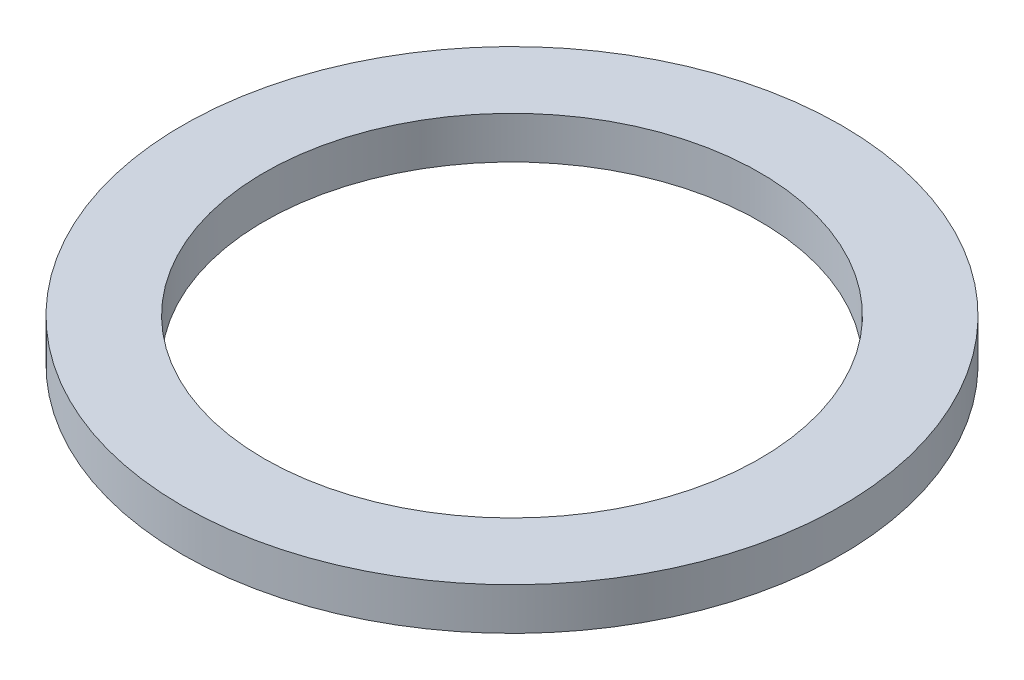
ISO-10303-21;
HEADER;
FILE_DESCRIPTION(('STEP AP214'),'2;1');
FILE_NAME('part.step','',(''),(''),'','','');
FILE_SCHEMA(('AUTOMOTIVE_DESIGN { 1 0 10303 214 1 1 1 1 }'));
ENDSEC;
DATA;
#1=APPLICATION_CONTEXT('core data for automotive mechanical design processes');
#2=APPLICATION_PROTOCOL_DEFINITION('international standard','automotive_design',2000,#1);
#3=PRODUCT_CONTEXT('',#1,'mechanical');
#4=PRODUCT('Part','Part','',(#3));
#5=PRODUCT_RELATED_PRODUCT_CATEGORY('part','',(#4));
#6=PRODUCT_DEFINITION_FORMATION('','',#4);
#7=PRODUCT_DEFINITION_CONTEXT('part definition',#1,'design');
#8=PRODUCT_DEFINITION('design','',#6,#7);
#9=PRODUCT_DEFINITION_SHAPE('','',#8);
#10=(LENGTH_UNIT() NAMED_UNIT(*) SI_UNIT(.MILLI.,.METRE.));
#11=(NAMED_UNIT(*) PLANE_ANGLE_UNIT() SI_UNIT($,.RADIAN.));
#12=(NAMED_UNIT(*) SI_UNIT($,.STERADIAN.) SOLID_ANGLE_UNIT());
#13=UNCERTAINTY_MEASURE_WITH_UNIT(LENGTH_MEASURE(1.E-05),#10,'distance_accuracy_value','');
#14=(GEOMETRIC_REPRESENTATION_CONTEXT(3) GLOBAL_UNCERTAINTY_ASSIGNED_CONTEXT((#13)) GLOBAL_UNIT_ASSIGNED_CONTEXT((#10,
#11,#12)) REPRESENTATION_CONTEXT('',''));
#15=CARTESIAN_POINT('',(0.,0.,0.));
#16=DIRECTION('',(0.,0.,1.));
#17=DIRECTION('',(1.,0.,0.));
#18=AXIS2_PLACEMENT_3D('',#15,#16,#17);
#19=CARTESIAN_POINT('',(0.,0.4064,0.));
#20=DIRECTION('',(0.,1.,0.));
#21=DIRECTION('',(0.,0.,1.));
#22=AXIS2_PLACEMENT_3D('',#19,#20,#21);
#23=PLANE('',#22);
#24=CARTESIAN_POINT('',(0.,0.4064,0.));
#25=DIRECTION('',(0.,1.,0.));
#26=DIRECTION('',(0.,0.,1.));
#27=AXIS2_PLACEMENT_3D('',#24,#25,#26);
#28=CIRCLE('',#27,3.175);
#29=CARTESIAN_POINT('',(0.,0.4064,3.175));
#30=VERTEX_POINT('',#29);
#31=EDGE_CURVE('E10',#30,#30,#28,.T.);
#32=ORIENTED_EDGE('',*,*,#31,.T.);
#33=EDGE_LOOP('',(#32));
#34=FACE_BOUND('',#33,.T.);
#35=CARTESIAN_POINT('',(0.,0.4064,0.));
#36=DIRECTION('',(0.,1.,0.));
#37=DIRECTION('',(0.,0.,1.));
#38=AXIS2_PLACEMENT_3D('',#35,#36,#37);
#39=CIRCLE('',#38,2.3876);
#40=CARTESIAN_POINT('',(0.,0.4064,2.3876));
#41=VERTEX_POINT('',#40);
#42=EDGE_CURVE('E42',#41,#41,#39,.T.);
#43=ORIENTED_EDGE('',*,*,#42,.F.);
#44=EDGE_LOOP('',(#43));
#45=FACE_BOUND('',#44,.T.);
#46=ADVANCED_FACE('F31',(#34,#45),#23,.T.);
#47=CARTESIAN_POINT('',(0.,0.,0.));
#48=DIRECTION('',(0.,1.,0.));
#49=DIRECTION('',(0.,0.,1.));
#50=AXIS2_PLACEMENT_3D('',#47,#48,#49);
#51=PLANE('',#50);
#52=CARTESIAN_POINT('',(0.,0.,0.));
#53=DIRECTION('',(0.,1.,0.));
#54=DIRECTION('',(0.,0.,1.));
#55=AXIS2_PLACEMENT_3D('',#52,#53,#54);
#56=CIRCLE('',#55,3.175);
#57=CARTESIAN_POINT('',(0.,0.,3.175));
#58=VERTEX_POINT('',#57);
#59=EDGE_CURVE('E35',#58,#58,#56,.T.);
#60=ORIENTED_EDGE('',*,*,#59,.F.);
#61=EDGE_LOOP('',(#60));
#62=FACE_BOUND('',#61,.T.);
#63=CARTESIAN_POINT('',(0.,0.,0.));
#64=DIRECTION('',(0.,1.,0.));
#65=DIRECTION('',(0.,0.,1.));
#66=AXIS2_PLACEMENT_3D('',#63,#64,#65);
#67=CIRCLE('',#66,2.3876);
#68=CARTESIAN_POINT('',(0.,0.,2.3876));
#69=VERTEX_POINT('',#68);
#70=EDGE_CURVE('E44',#69,#69,#67,.T.);
#71=ORIENTED_EDGE('',*,*,#70,.T.);
#72=EDGE_LOOP('',(#71));
#73=FACE_BOUND('',#72,.T.);
#74=ADVANCED_FACE('F54',(#62,#73),#51,.F.);
#75=CARTESIAN_POINT('',(0.,0.4064,0.));
#76=DIRECTION('',(0.,-1.,0.));
#77=DIRECTION('',(0.,0.,-1.));
#78=AXIS2_PLACEMENT_3D('',#75,#76,#77);
#79=CYLINDRICAL_SURFACE('',#78,3.175);
#80=ORIENTED_EDGE('',*,*,#31,.F.);
#81=EDGE_LOOP('',(#80));
#82=FACE_BOUND('',#81,.T.);
#83=ORIENTED_EDGE('',*,*,#59,.T.);
#84=EDGE_LOOP('',(#83));
#85=FACE_BOUND('',#84,.T.);
#86=ADVANCED_FACE('F33',(#82,#85),#79,.T.);
#87=CARTESIAN_POINT('',(0.,0.4064,0.));
#88=DIRECTION('',(0.,-1.,0.));
#89=DIRECTION('',(0.,0.,-1.));
#90=AXIS2_PLACEMENT_3D('',#87,#88,#89);
#91=CYLINDRICAL_SURFACE('',#90,2.3876);
#92=ORIENTED_EDGE('',*,*,#42,.T.);
#93=EDGE_LOOP('',(#92));
#94=FACE_BOUND('',#93,.T.);
#95=ORIENTED_EDGE('',*,*,#70,.F.);
#96=EDGE_LOOP('',(#95));
#97=FACE_BOUND('',#96,.T.);
#98=ADVANCED_FACE('F50',(#94,#97),#91,.F.);
#99=CLOSED_SHELL('',(#46,#74,#86,#98));
#100=MANIFOLD_SOLID_BREP('B2',#99);
#101=ADVANCED_BREP_SHAPE_REPRESENTATION('',(#18,#100),#14);
#102=SHAPE_DEFINITION_REPRESENTATION(#9,#101);
ENDSEC;
END-ISO-10303-21;
